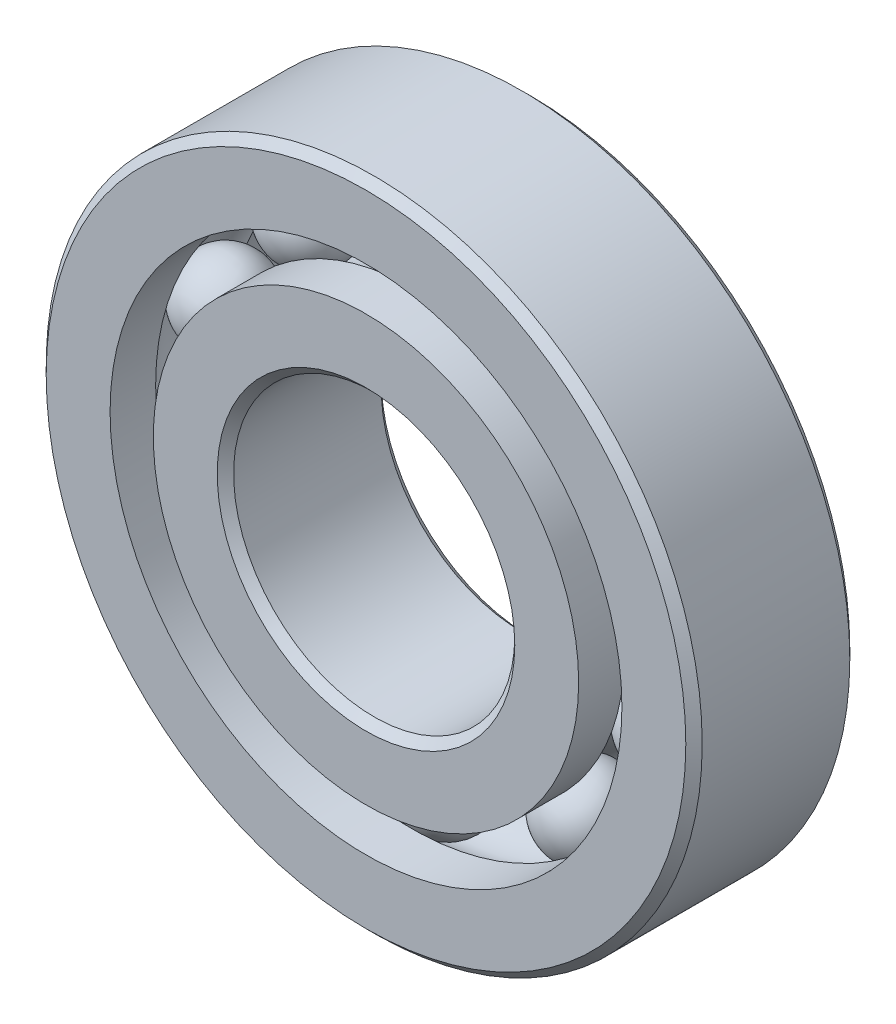
ISO-10303-21;
HEADER;
FILE_DESCRIPTION(('STEP AP214'),'2;1');
FILE_NAME('part.step','',(''),(''),'','','');
FILE_SCHEMA(('AUTOMOTIVE_DESIGN { 1 0 10303 214 1 1 1 1 }'));
ENDSEC;
DATA;
#1=APPLICATION_CONTEXT('core data for automotive mechanical design processes');
#2=APPLICATION_PROTOCOL_DEFINITION('international standard','automotive_design',2000,#1);
#3=PRODUCT_CONTEXT('',#1,'mechanical');
#4=PRODUCT('Part','Part','',(#3));
#5=PRODUCT_RELATED_PRODUCT_CATEGORY('part','',(#4));
#6=PRODUCT_DEFINITION_FORMATION('','',#4);
#7=PRODUCT_DEFINITION_CONTEXT('part definition',#1,'design');
#8=PRODUCT_DEFINITION('design','',#6,#7);
#9=PRODUCT_DEFINITION_SHAPE('','',#8);
#10=(LENGTH_UNIT() NAMED_UNIT(*) SI_UNIT(.MILLI.,.METRE.));
#11=(NAMED_UNIT(*) PLANE_ANGLE_UNIT() SI_UNIT($,.RADIAN.));
#12=(NAMED_UNIT(*) SI_UNIT($,.STERADIAN.) SOLID_ANGLE_UNIT());
#13=UNCERTAINTY_MEASURE_WITH_UNIT(LENGTH_MEASURE(1.E-05),#10,'distance_accuracy_value','');
#14=(GEOMETRIC_REPRESENTATION_CONTEXT(3) GLOBAL_UNCERTAINTY_ASSIGNED_CONTEXT((#13)) GLOBAL_UNIT_ASSIGNED_CONTEXT((#10,
#11,#12)) REPRESENTATION_CONTEXT('',''));
#15=CARTESIAN_POINT('',(0.,0.,0.));
#16=DIRECTION('',(0.,0.,1.));
#17=DIRECTION('',(1.,0.,0.));
#18=AXIS2_PLACEMENT_3D('',#15,#16,#17);
#19=CARTESIAN_POINT('',(-4.66554544007142,6.42157239285121,0.));
#20=DIRECTION('',(0.,0.,1.));
#21=DIRECTION('',(-0.587785252292462,0.809016994374955,0.));
#22=AXIS2_PLACEMENT_3D('',#19,#20,#21);
#23=SPHERICAL_SURFACE('',#22,1.43574962434293);
#24=CARTESIAN_POINT('',(-4.66554544007142,6.42157239285121,1.43574962434293));
#25=VERTEX_POINT('',#24);
#26=VERTEX_LOOP('',#25);
#27=FACE_BOUND('',#26,.T.);
#28=ADVANCED_FACE('F39',(#27),#23,.T.);
#29=CLOSED_SHELL('',(#28));
#30=MANIFOLD_SOLID_BREP('B2',#29);
#31=CARTESIAN_POINT('',(-7.54901109809275,2.45282239285123,0.));
#32=DIRECTION('',(0.,0.,1.));
#33=DIRECTION('',(-0.95105651629515,0.309016994374958,0.));
#34=AXIS2_PLACEMENT_3D('',#31,#32,#33);
#35=SPHERICAL_SURFACE('',#34,1.43574962434293);
#36=CARTESIAN_POINT('',(-7.54901109809275,2.45282239285123,1.43574962434293));
#37=VERTEX_POINT('',#36);
#38=VERTEX_LOOP('',#37);
#39=FACE_BOUND('',#38,.T.);
#40=ADVANCED_FACE('F59',(#39),#35,.T.);
#41=CLOSED_SHELL('',(#40));
#42=MANIFOLD_SOLID_BREP('B6',#41);
#43=CARTESIAN_POINT('',(-7.54901109809281,-2.45282239285107,0.));
#44=DIRECTION('',(0.,0.,1.));
#45=DIRECTION('',(-0.951056516295157,-0.309016994374938,0.));
#46=AXIS2_PLACEMENT_3D('',#43,#44,#45);
#47=SPHERICAL_SURFACE('',#46,1.43574962434293);
#48=CARTESIAN_POINT('',(-7.54901109809281,-2.45282239285107,1.43574962434293));
#49=VERTEX_POINT('',#48);
#50=VERTEX_LOOP('',#49);
#51=FACE_BOUND('',#50,.T.);
#52=ADVANCED_FACE('F79',(#51),#47,.T.);
#53=CLOSED_SHELL('',(#52));
#54=MANIFOLD_SOLID_BREP('B35',#53);
#55=CARTESIAN_POINT('',(-4.66554544007156,-6.4215723928511,0.));
#56=DIRECTION('',(0.,0.,1.));
#57=DIRECTION('',(-0.58778525229248,-0.809016994374942,0.));
#58=AXIS2_PLACEMENT_3D('',#55,#56,#57);
#59=SPHERICAL_SURFACE('',#58,1.43574962434293);
#60=CARTESIAN_POINT('',(-4.66554544007156,-6.4215723928511,1.43574962434293));
#61=VERTEX_POINT('',#60);
#62=VERTEX_LOOP('',#61);
#63=FACE_BOUND('',#62,.T.);
#64=ADVANCED_FACE('F99',(#63),#59,.T.);
#65=CLOSED_SHELL('',(#64));
#66=MANIFOLD_SOLID_BREP('B55',#65);
#67=CARTESIAN_POINT('',(0.,-7.9375,0.));
#68=DIRECTION('',(0.,0.,1.));
#69=DIRECTION('',(0.,-1.,0.));
#70=AXIS2_PLACEMENT_3D('',#67,#68,#69);
#71=SPHERICAL_SURFACE('',#70,1.43574962434293);
#72=CARTESIAN_POINT('',(0.,-7.9375,1.43574962434293));
#73=VERTEX_POINT('',#72);
#74=VERTEX_LOOP('',#73);
#75=FACE_BOUND('',#74,.T.);
#76=ADVANCED_FACE('F119',(#75),#71,.T.);
#77=CLOSED_SHELL('',(#76));
#78=MANIFOLD_SOLID_BREP('B75',#77);
#79=CARTESIAN_POINT('',(4.66554544007147,-6.42157239285117,0.));
#80=DIRECTION('',(0.,0.,1.));
#81=DIRECTION('',(0.587785252292469,-0.809016994374951,0.));
#82=AXIS2_PLACEMENT_3D('',#79,#80,#81);
#83=SPHERICAL_SURFACE('',#82,1.43574962434293);
#84=CARTESIAN_POINT('',(4.66554544007147,-6.42157239285117,1.43574962434293));
#85=VERTEX_POINT('',#84);
#86=VERTEX_LOOP('',#85);
#87=FACE_BOUND('',#86,.T.);
#88=ADVANCED_FACE('F139',(#87),#83,.T.);
#89=CLOSED_SHELL('',(#88));
#90=MANIFOLD_SOLID_BREP('B95',#89);
#91=CARTESIAN_POINT('',(7.54901109809277,-2.45282239285118,0.));
#92=DIRECTION('',(0.,0.,1.));
#93=DIRECTION('',(0.951056516295152,-0.309016994374952,0.));
#94=AXIS2_PLACEMENT_3D('',#91,#92,#93);
#95=SPHERICAL_SURFACE('',#94,1.43574962434293);
#96=CARTESIAN_POINT('',(7.54901109809277,-2.45282239285118,1.43574962434293));
#97=VERTEX_POINT('',#96);
#98=VERTEX_LOOP('',#97);
#99=FACE_BOUND('',#98,.T.);
#100=ADVANCED_FACE('F159',(#99),#95,.T.);
#101=CLOSED_SHELL('',(#100));
#102=MANIFOLD_SOLID_BREP('B115',#101);
#103=CARTESIAN_POINT('',(7.54901109809279,2.45282239285112,0.));
#104=DIRECTION('',(0.,0.,1.));
#105=DIRECTION('',(0.951056516295155,0.309016994374945,0.));
#106=AXIS2_PLACEMENT_3D('',#103,#104,#105);
#107=SPHERICAL_SURFACE('',#106,1.43574962434293);
#108=CARTESIAN_POINT('',(7.54901109809279,2.45282239285112,1.43574962434293));
#109=VERTEX_POINT('',#108);
#110=VERTEX_LOOP('',#109);
#111=FACE_BOUND('',#110,.T.);
#112=ADVANCED_FACE('F179',(#111),#107,.T.);
#113=CLOSED_SHELL('',(#112));
#114=MANIFOLD_SOLID_BREP('B135',#113);
#115=CARTESIAN_POINT('',(4.66554544007152,6.42157239285114,0.));
#116=DIRECTION('',(0.,0.,1.));
#117=DIRECTION('',(0.587785252292474,0.809016994374947,0.));
#118=AXIS2_PLACEMENT_3D('',#115,#116,#117);
#119=SPHERICAL_SURFACE('',#118,1.43574962434293);
#120=CARTESIAN_POINT('',(4.66554544007152,6.42157239285114,1.43574962434293));
#121=VERTEX_POINT('',#120);
#122=VERTEX_LOOP('',#121);
#123=FACE_BOUND('',#122,.T.);
#124=ADVANCED_FACE('F199',(#123),#119,.T.);
#125=CLOSED_SHELL('',(#124));
#126=MANIFOLD_SOLID_BREP('B155',#125);
#127=CARTESIAN_POINT('',(0.,7.9375,0.));
#128=DIRECTION('',(0.,0.,1.));
#129=DIRECTION('',(0.,1.,0.));
#130=AXIS2_PLACEMENT_3D('',#127,#128,#129);
#131=SPHERICAL_SURFACE('',#130,1.43574962434293);
#132=CARTESIAN_POINT('',(0.,7.9375,1.43574962434293));
#133=VERTEX_POINT('',#132);
#134=VERTEX_LOOP('',#133);
#135=FACE_BOUND('',#134,.T.);
#136=ADVANCED_FACE('F221',(#135),#131,.T.);
#137=CLOSED_SHELL('',(#136));
#138=MANIFOLD_SOLID_BREP('B175',#137);
#139=CARTESIAN_POINT('',(0.,7.20480769230769,2.778125));
#140=DIRECTION('',(0.,0.,-1.));
#141=DIRECTION('',(-1.,0.,0.));
#142=AXIS2_PLACEMENT_3D('',#139,#140,#141);
#143=PLANE('',#142);
#144=CARTESIAN_POINT('',(0.,0.,2.778125));
#145=DIRECTION('',(0.,0.,1.));
#146=DIRECTION('',(1.,0.,0.));
#147=AXIS2_PLACEMENT_3D('',#144,#145,#146);
#148=CIRCLE('',#147,5.0403125);
#149=CARTESIAN_POINT('',(5.0403125,0.,2.778125));
#150=VERTEX_POINT('',#149);
#151=EDGE_CURVE('E268',#150,#150,#148,.T.);
#152=ORIENTED_EDGE('',*,*,#151,.F.);
#153=EDGE_LOOP('',(#152));
#154=FACE_BOUND('',#153,.T.);
#155=CARTESIAN_POINT('',(0.,0.,2.778125));
#156=DIRECTION('',(0.,0.,1.));
#157=DIRECTION('',(1.,0.,0.));
#158=AXIS2_PLACEMENT_3D('',#155,#156,#157);
#159=CIRCLE('',#158,7.20480769230769);
#160=CARTESIAN_POINT('',(7.20480769230769,0.,2.778125));
#161=VERTEX_POINT('',#160);
#162=EDGE_CURVE('E220',#161,#161,#159,.T.);
#163=ORIENTED_EDGE('',*,*,#162,.T.);
#164=EDGE_LOOP('',(#163));
#165=FACE_BOUND('',#164,.T.);
#166=ADVANCED_FACE('F240',(#154,#165),#143,.F.);
#167=CARTESIAN_POINT('',(0.,0.,2.778125));
#168=DIRECTION('',(0.,0.,1.));
#169=DIRECTION('',(1.,0.,0.));
#170=AXIS2_PLACEMENT_3D('',#167,#168,#169);
#171=CYLINDRICAL_SURFACE('',#170,7.20480769230769);
#172=ORIENTED_EDGE('',*,*,#162,.F.);
#173=EDGE_LOOP('',(#172));
#174=FACE_BOUND('',#173,.T.);
#175=CARTESIAN_POINT('',(0.,0.,1.23472222222222));
#176=DIRECTION('',(0.,0.,1.));
#177=DIRECTION('',(1.,0.,0.));
#178=AXIS2_PLACEMENT_3D('',#175,#176,#177);
#179=CIRCLE('',#178,7.20480769230769);
#180=CARTESIAN_POINT('',(7.20480769230769,0.,1.23472222222222));
#181=VERTEX_POINT('',#180);
#182=EDGE_CURVE('E246',#181,#181,#179,.T.);
#183=ORIENTED_EDGE('',*,*,#182,.T.);
#184=EDGE_LOOP('',(#183));
#185=FACE_BOUND('',#184,.T.);
#186=ADVANCED_FACE('F275',(#174,#185),#171,.T.);
#187=CARTESIAN_POINT('',(0.,0.,0.));
#188=DIRECTION('',(0.,0.,1.));
#189=DIRECTION('',(1.,0.,0.));
#190=AXIS2_PLACEMENT_3D('',#187,#188,#189);
#191=TOROIDAL_SURFACE('',#190,7.9375,1.43574962434293);
#192=ORIENTED_EDGE('',*,*,#182,.F.);
#193=EDGE_LOOP('',(#192));
#194=FACE_BOUND('',#193,.T.);
#195=CARTESIAN_POINT('',(0.,0.,-1.23472222222222));
#196=DIRECTION('',(0.,0.,1.));
#197=DIRECTION('',(1.,0.,0.));
#198=AXIS2_PLACEMENT_3D('',#195,#196,#197);
#199=CIRCLE('',#198,7.20480769230769);
#200=CARTESIAN_POINT('',(7.20480769230769,0.,-1.23472222222222));
#201=VERTEX_POINT('',#200);
#202=EDGE_CURVE('E250',#201,#201,#199,.T.);
#203=ORIENTED_EDGE('',*,*,#202,.T.);
#204=EDGE_LOOP('',(#203));
#205=FACE_BOUND('',#204,.T.);
#206=ADVANCED_FACE('F279',(#194,#205),#191,.F.);
#207=CARTESIAN_POINT('',(0.,0.,2.778125));
#208=DIRECTION('',(0.,0.,1.));
#209=DIRECTION('',(1.,0.,0.));
#210=AXIS2_PLACEMENT_3D('',#207,#208,#209);
#211=CYLINDRICAL_SURFACE('',#210,7.20480769230769);
#212=ORIENTED_EDGE('',*,*,#202,.F.);
#213=EDGE_LOOP('',(#212));
#214=FACE_BOUND('',#213,.T.);
#215=CARTESIAN_POINT('',(0.,0.,-2.778125));
#216=DIRECTION('',(0.,0.,1.));
#217=DIRECTION('',(1.,0.,0.));
#218=AXIS2_PLACEMENT_3D('',#215,#216,#217);
#219=CIRCLE('',#218,7.20480769230769);
#220=CARTESIAN_POINT('',(7.20480769230769,0.,-2.778125));
#221=VERTEX_POINT('',#220);
#222=EDGE_CURVE('E254',#221,#221,#219,.T.);
#223=ORIENTED_EDGE('',*,*,#222,.T.);
#224=EDGE_LOOP('',(#223));
#225=FACE_BOUND('',#224,.T.);
#226=ADVANCED_FACE('F284',(#214,#225),#211,.T.);
#227=CARTESIAN_POINT('',(0.,5.0403125,-2.778125));
#228=DIRECTION('',(0.,0.,1.));
#229=DIRECTION('',(1.,0.,0.));
#230=AXIS2_PLACEMENT_3D('',#227,#228,#229);
#231=PLANE('',#230);
#232=ORIENTED_EDGE('',*,*,#222,.F.);
#233=EDGE_LOOP('',(#232));
#234=FACE_BOUND('',#233,.T.);
#235=CARTESIAN_POINT('',(0.,0.,-2.778125));
#236=DIRECTION('',(0.,0.,1.));
#237=DIRECTION('',(1.,0.,0.));
#238=AXIS2_PLACEMENT_3D('',#235,#236,#237);
#239=CIRCLE('',#238,5.0403125);
#240=CARTESIAN_POINT('',(5.0403125,0.,-2.778125));
#241=VERTEX_POINT('',#240);
#242=EDGE_CURVE('E259',#241,#241,#239,.T.);
#243=ORIENTED_EDGE('',*,*,#242,.T.);
#244=EDGE_LOOP('',(#243));
#245=FACE_BOUND('',#244,.T.);
#246=ADVANCED_FACE('F290',(#234,#245),#231,.F.);
#247=CARTESIAN_POINT('',(0.,0.,-2.5003125));
#248=DIRECTION('',(0.,0.,-1.));
#249=DIRECTION('',(-1.,0.,0.));
#250=AXIS2_PLACEMENT_3D('',#247,#248,#249);
#251=CONICAL_SURFACE('',#250,4.7625,0.785398163397444);
#252=ORIENTED_EDGE('',*,*,#242,.F.);
#253=EDGE_LOOP('',(#252));
#254=FACE_BOUND('',#253,.T.);
#255=CARTESIAN_POINT('',(0.,0.,-2.5003125));
#256=DIRECTION('',(0.,0.,1.));
#257=DIRECTION('',(1.,0.,0.));
#258=AXIS2_PLACEMENT_3D('',#255,#256,#257);
#259=CIRCLE('',#258,4.7625);
#260=CARTESIAN_POINT('',(4.7625,0.,-2.5003125));
#261=VERTEX_POINT('',#260);
#262=EDGE_CURVE('E262',#261,#261,#259,.T.);
#263=ORIENTED_EDGE('',*,*,#262,.T.);
#264=EDGE_LOOP('',(#263));
#265=FACE_BOUND('',#264,.T.);
#266=ADVANCED_FACE('F294',(#254,#265),#251,.F.);
#267=CARTESIAN_POINT('',(0.,0.,2.778125));
#268=DIRECTION('',(0.,0.,1.));
#269=DIRECTION('',(1.,0.,0.));
#270=AXIS2_PLACEMENT_3D('',#267,#268,#269);
#271=CYLINDRICAL_SURFACE('',#270,4.7625);
#272=ORIENTED_EDGE('',*,*,#262,.F.);
#273=EDGE_LOOP('',(#272));
#274=FACE_BOUND('',#273,.T.);
#275=CARTESIAN_POINT('',(0.,0.,2.5003125));
#276=DIRECTION('',(0.,0.,1.));
#277=DIRECTION('',(1.,0.,0.));
#278=AXIS2_PLACEMENT_3D('',#275,#276,#277);
#279=CIRCLE('',#278,4.7625);
#280=CARTESIAN_POINT('',(4.7625,0.,2.5003125));
#281=VERTEX_POINT('',#280);
#282=EDGE_CURVE('E265',#281,#281,#279,.T.);
#283=ORIENTED_EDGE('',*,*,#282,.T.);
#284=EDGE_LOOP('',(#283));
#285=FACE_BOUND('',#284,.T.);
#286=ADVANCED_FACE('F298',(#274,#285),#271,.F.);
#287=CARTESIAN_POINT('',(0.,0.,2.778125));
#288=DIRECTION('',(0.,0.,1.));
#289=DIRECTION('',(1.,0.,0.));
#290=AXIS2_PLACEMENT_3D('',#287,#288,#289);
#291=CONICAL_SURFACE('',#290,5.0403125,0.785398163397455);
#292=ORIENTED_EDGE('',*,*,#282,.F.);
#293=EDGE_LOOP('',(#292));
#294=FACE_BOUND('',#293,.T.);
#295=ORIENTED_EDGE('',*,*,#151,.T.);
#296=EDGE_LOOP('',(#295));
#297=FACE_BOUND('',#296,.T.);
#298=ADVANCED_FACE('F272',(#294,#297),#291,.F.);
#299=CLOSED_SHELL('',(#166,#186,#206,#226,#246,#266,#286,#298));
#300=MANIFOLD_SOLID_BREP('B195',#299);
#301=CARTESIAN_POINT('',(0.,0.,2.5003125));
#302=DIRECTION('',(0.,0.,-1.));
#303=DIRECTION('',(-1.,0.,0.));
#304=AXIS2_PLACEMENT_3D('',#301,#302,#303);
#305=CONICAL_SURFACE('',#304,11.1125,0.785398163397446);
#306=CARTESIAN_POINT('',(0.,0.,2.778125));
#307=DIRECTION('',(0.,0.,1.));
#308=DIRECTION('',(1.,0.,0.));
#309=AXIS2_PLACEMENT_3D('',#306,#307,#308);
#310=CIRCLE('',#309,10.8346875);
#311=CARTESIAN_POINT('',(10.8346875,0.,2.778125));
#312=VERTEX_POINT('',#311);
#313=EDGE_CURVE('E389',#312,#312,#310,.T.);
#314=ORIENTED_EDGE('',*,*,#313,.F.);
#315=EDGE_LOOP('',(#314));
#316=FACE_BOUND('',#315,.T.);
#317=CARTESIAN_POINT('',(0.,0.,2.5003125));
#318=DIRECTION('',(0.,0.,1.));
#319=DIRECTION('',(1.,0.,0.));
#320=AXIS2_PLACEMENT_3D('',#317,#318,#319);
#321=CIRCLE('',#320,11.1125);
#322=CARTESIAN_POINT('',(11.1125,0.,2.5003125));
#323=VERTEX_POINT('',#322);
#324=EDGE_CURVE('E239',#323,#323,#321,.T.);
#325=ORIENTED_EDGE('',*,*,#324,.T.);
#326=EDGE_LOOP('',(#325));
#327=FACE_BOUND('',#326,.T.);
#328=ADVANCED_FACE('F361',(#316,#327),#305,.T.);
#329=CARTESIAN_POINT('',(0.,0.,2.778125));
#330=DIRECTION('',(0.,0.,1.));
#331=DIRECTION('',(1.,0.,0.));
#332=AXIS2_PLACEMENT_3D('',#329,#330,#331);
#333=CYLINDRICAL_SURFACE('',#332,11.1125);
#334=ORIENTED_EDGE('',*,*,#324,.F.);
#335=EDGE_LOOP('',(#334));
#336=FACE_BOUND('',#335,.T.);
#337=CARTESIAN_POINT('',(0.,0.,-2.5003125));
#338=DIRECTION('',(0.,0.,1.));
#339=DIRECTION('',(1.,0.,0.));
#340=AXIS2_PLACEMENT_3D('',#337,#338,#339);
#341=CIRCLE('',#340,11.1125);
#342=CARTESIAN_POINT('',(11.1125,0.,-2.5003125));
#343=VERTEX_POINT('',#342);
#344=EDGE_CURVE('E367',#343,#343,#341,.T.);
#345=ORIENTED_EDGE('',*,*,#344,.T.);
#346=EDGE_LOOP('',(#345));
#347=FACE_BOUND('',#346,.T.);
#348=ADVANCED_FACE('F396',(#336,#347),#333,.T.);
#349=CARTESIAN_POINT('',(0.,0.,-2.778125));
#350=DIRECTION('',(0.,0.,1.));
#351=DIRECTION('',(1.,0.,0.));
#352=AXIS2_PLACEMENT_3D('',#349,#350,#351);
#353=CONICAL_SURFACE('',#352,10.8346875,0.785398163397445);
#354=ORIENTED_EDGE('',*,*,#344,.F.);
#355=EDGE_LOOP('',(#354));
#356=FACE_BOUND('',#355,.T.);
#357=CARTESIAN_POINT('',(0.,0.,-2.778125));
#358=DIRECTION('',(0.,0.,1.));
#359=DIRECTION('',(1.,0.,0.));
#360=AXIS2_PLACEMENT_3D('',#357,#358,#359);
#361=CIRCLE('',#360,10.8346875);
#362=CARTESIAN_POINT('',(10.8346875,0.,-2.778125));
#363=VERTEX_POINT('',#362);
#364=EDGE_CURVE('E371',#363,#363,#361,.T.);
#365=ORIENTED_EDGE('',*,*,#364,.T.);
#366=EDGE_LOOP('',(#365));
#367=FACE_BOUND('',#366,.T.);
#368=ADVANCED_FACE('F400',(#356,#367),#353,.T.);
#369=CARTESIAN_POINT('',(0.,10.8346875,-2.778125));
#370=DIRECTION('',(0.,0.,1.));
#371=DIRECTION('',(1.,0.,0.));
#372=AXIS2_PLACEMENT_3D('',#369,#370,#371);
#373=PLANE('',#372);
#374=ORIENTED_EDGE('',*,*,#364,.F.);
#375=EDGE_LOOP('',(#374));
#376=FACE_BOUND('',#375,.T.);
#377=CARTESIAN_POINT('',(0.,0.,-2.778125));
#378=DIRECTION('',(0.,0.,1.));
#379=DIRECTION('',(1.,0.,0.));
#380=AXIS2_PLACEMENT_3D('',#377,#378,#379);
#381=CIRCLE('',#380,8.67019230769231);
#382=CARTESIAN_POINT('',(8.67019230769231,0.,-2.778125));
#383=VERTEX_POINT('',#382);
#384=EDGE_CURVE('E375',#383,#383,#381,.T.);
#385=ORIENTED_EDGE('',*,*,#384,.T.);
#386=EDGE_LOOP('',(#385));
#387=FACE_BOUND('',#386,.T.);
#388=ADVANCED_FACE('F405',(#376,#387),#373,.F.);
#389=CARTESIAN_POINT('',(0.,0.,2.778125));
#390=DIRECTION('',(0.,0.,1.));
#391=DIRECTION('',(1.,0.,0.));
#392=AXIS2_PLACEMENT_3D('',#389,#390,#391);
#393=CYLINDRICAL_SURFACE('',#392,8.67019230769231);
#394=ORIENTED_EDGE('',*,*,#384,.F.);
#395=EDGE_LOOP('',(#394));
#396=FACE_BOUND('',#395,.T.);
#397=CARTESIAN_POINT('',(0.,0.,-1.23472222222222));
#398=DIRECTION('',(0.,0.,1.));
#399=DIRECTION('',(1.,0.,0.));
#400=AXIS2_PLACEMENT_3D('',#397,#398,#399);
#401=CIRCLE('',#400,8.67019230769231);
#402=CARTESIAN_POINT('',(8.67019230769231,0.,-1.23472222222222));
#403=VERTEX_POINT('',#402);
#404=EDGE_CURVE('E380',#403,#403,#401,.T.);
#405=ORIENTED_EDGE('',*,*,#404,.T.);
#406=EDGE_LOOP('',(#405));
#407=FACE_BOUND('',#406,.T.);
#408=ADVANCED_FACE('F411',(#396,#407),#393,.F.);
#409=CARTESIAN_POINT('',(0.,0.,0.));
#410=DIRECTION('',(0.,0.,1.));
#411=DIRECTION('',(1.,0.,0.));
#412=AXIS2_PLACEMENT_3D('',#409,#410,#411);
#413=TOROIDAL_SURFACE('',#412,7.9375,1.43574962434293);
#414=ORIENTED_EDGE('',*,*,#404,.F.);
#415=EDGE_LOOP('',(#414));
#416=FACE_BOUND('',#415,.T.);
#417=CARTESIAN_POINT('',(0.,0.,1.23472222222222));
#418=DIRECTION('',(0.,0.,1.));
#419=DIRECTION('',(1.,0.,0.));
#420=AXIS2_PLACEMENT_3D('',#417,#418,#419);
#421=CIRCLE('',#420,8.67019230769231);
#422=CARTESIAN_POINT('',(8.67019230769231,0.,1.23472222222222));
#423=VERTEX_POINT('',#422);
#424=EDGE_CURVE('E383',#423,#423,#421,.T.);
#425=ORIENTED_EDGE('',*,*,#424,.T.);
#426=EDGE_LOOP('',(#425));
#427=FACE_BOUND('',#426,.T.);
#428=ADVANCED_FACE('F415',(#416,#427),#413,.F.);
#429=CARTESIAN_POINT('',(0.,0.,2.778125));
#430=DIRECTION('',(0.,0.,1.));
#431=DIRECTION('',(1.,0.,0.));
#432=AXIS2_PLACEMENT_3D('',#429,#430,#431);
#433=CYLINDRICAL_SURFACE('',#432,8.67019230769231);
#434=ORIENTED_EDGE('',*,*,#424,.F.);
#435=EDGE_LOOP('',(#434));
#436=FACE_BOUND('',#435,.T.);
#437=CARTESIAN_POINT('',(0.,0.,2.778125));
#438=DIRECTION('',(0.,0.,1.));
#439=DIRECTION('',(1.,0.,0.));
#440=AXIS2_PLACEMENT_3D('',#437,#438,#439);
#441=CIRCLE('',#440,8.67019230769231);
#442=CARTESIAN_POINT('',(8.67019230769231,0.,2.778125));
#443=VERTEX_POINT('',#442);
#444=EDGE_CURVE('E386',#443,#443,#441,.T.);
#445=ORIENTED_EDGE('',*,*,#444,.T.);
#446=EDGE_LOOP('',(#445));
#447=FACE_BOUND('',#446,.T.);
#448=ADVANCED_FACE('F419',(#436,#447),#433,.F.);
#449=CARTESIAN_POINT('',(0.,10.8346875,2.778125));
#450=DIRECTION('',(0.,0.,-1.));
#451=DIRECTION('',(-1.,0.,0.));
#452=AXIS2_PLACEMENT_3D('',#449,#450,#451);
#453=PLANE('',#452);
#454=ORIENTED_EDGE('',*,*,#444,.F.);
#455=EDGE_LOOP('',(#454));
#456=FACE_BOUND('',#455,.T.);
#457=ORIENTED_EDGE('',*,*,#313,.T.);
#458=EDGE_LOOP('',(#457));
#459=FACE_BOUND('',#458,.T.);
#460=ADVANCED_FACE('F393',(#456,#459),#453,.F.);
#461=CLOSED_SHELL('',(#328,#348,#368,#388,#408,#428,#448,#460));
#462=MANIFOLD_SOLID_BREP('B215',#461);
#463=ADVANCED_BREP_SHAPE_REPRESENTATION('',(#18,#30,#42,#54,#66,#78,#90,#102,#114,#126,#138,
#300,#462),#14);
#464=SHAPE_DEFINITION_REPRESENTATION(#9,#463);
ENDSEC;
END-ISO-10303-21;
